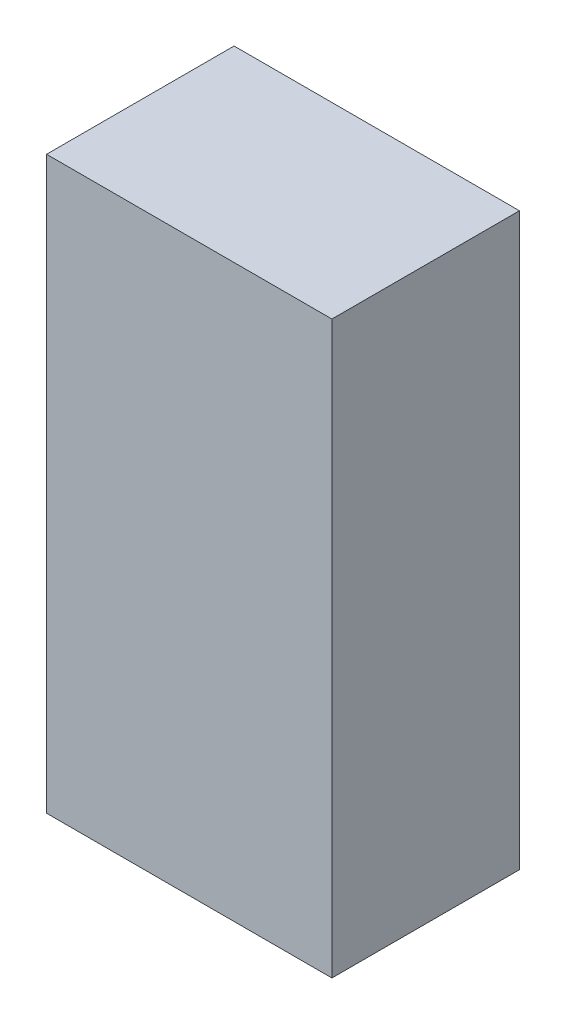
ISO-10303-21;
HEADER;
FILE_DESCRIPTION(('STEP AP214'),'2;1');
FILE_NAME('part.step','',(''),(''),'','','');
FILE_SCHEMA(('AUTOMOTIVE_DESIGN { 1 0 10303 214 1 1 1 1 }'));
ENDSEC;
DATA;
#1=APPLICATION_CONTEXT('core data for automotive mechanical design processes');
#2=APPLICATION_PROTOCOL_DEFINITION('international standard','automotive_design',2000,#1);
#3=PRODUCT_CONTEXT('',#1,'mechanical');
#4=PRODUCT('Part','Part','',(#3));
#5=PRODUCT_RELATED_PRODUCT_CATEGORY('part','',(#4));
#6=PRODUCT_DEFINITION_FORMATION('','',#4);
#7=PRODUCT_DEFINITION_CONTEXT('part definition',#1,'design');
#8=PRODUCT_DEFINITION('design','',#6,#7);
#9=PRODUCT_DEFINITION_SHAPE('','',#8);
#10=(LENGTH_UNIT() NAMED_UNIT(*) SI_UNIT(.MILLI.,.METRE.));
#11=(NAMED_UNIT(*) PLANE_ANGLE_UNIT() SI_UNIT($,.RADIAN.));
#12=(NAMED_UNIT(*) SI_UNIT($,.STERADIAN.) SOLID_ANGLE_UNIT());
#13=UNCERTAINTY_MEASURE_WITH_UNIT(LENGTH_MEASURE(1.E-05),#10,'distance_accuracy_value','');
#14=(GEOMETRIC_REPRESENTATION_CONTEXT(3) GLOBAL_UNCERTAINTY_ASSIGNED_CONTEXT((#13)) GLOBAL_UNIT_ASSIGNED_CONTEXT((#10,
#11,#12)) REPRESENTATION_CONTEXT('',''));
#15=CARTESIAN_POINT('',(0.,0.,0.));
#16=DIRECTION('',(0.,0.,1.));
#17=DIRECTION('',(1.,0.,0.));
#18=AXIS2_PLACEMENT_3D('',#15,#16,#17);
#19=CARTESIAN_POINT('',(17.5,70.,11.5));
#20=DIRECTION('',(-1.,0.,0.));
#21=DIRECTION('',(0.,0.,1.));
#22=AXIS2_PLACEMENT_3D('',#19,#20,#21);
#23=PLANE('',#22);
#24=DIRECTION('',(0.,0.,-1.));
#25=VECTOR('',#24,1.);
#26=CARTESIAN_POINT('',(17.5,0.,11.5));
#27=LINE('',#26,#25);
#28=CARTESIAN_POINT('',(17.5,0.,11.5));
#29=VERTEX_POINT('',#28);
#30=CARTESIAN_POINT('',(17.5,0.,-11.5));
#31=VERTEX_POINT('',#30);
#32=EDGE_CURVE('E98',#29,#31,#27,.T.);
#33=ORIENTED_EDGE('',*,*,#32,.T.);
#34=DIRECTION('',(0.,-1.,0.));
#35=VECTOR('',#34,1.);
#36=CARTESIAN_POINT('',(17.5,70.,-11.5));
#37=LINE('',#36,#35);
#38=CARTESIAN_POINT('',(17.5,70.,-11.5));
#39=VERTEX_POINT('',#38);
#40=EDGE_CURVE('E11',#39,#31,#37,.T.);
#41=ORIENTED_EDGE('',*,*,#40,.F.);
#42=DIRECTION('',(0.,0.,-1.));
#43=VECTOR('',#42,1.);
#44=CARTESIAN_POINT('',(17.5,70.,11.5));
#45=LINE('',#44,#43);
#46=CARTESIAN_POINT('',(17.5,70.,11.5));
#47=VERTEX_POINT('',#46);
#48=EDGE_CURVE('E86',#47,#39,#45,.T.);
#49=ORIENTED_EDGE('',*,*,#48,.F.);
#50=DIRECTION('',(0.,-1.,0.));
#51=VECTOR('',#50,1.);
#52=CARTESIAN_POINT('',(17.5,70.,11.5));
#53=LINE('',#52,#51);
#54=EDGE_CURVE('E94',#47,#29,#53,.T.);
#55=ORIENTED_EDGE('',*,*,#54,.T.);
#56=EDGE_LOOP('',(#33,#41,#49,#55));
#57=FACE_BOUND('',#56,.T.);
#58=ADVANCED_FACE('F35',(#57),#23,.F.);
#59=CARTESIAN_POINT('',(-17.5,70.,-11.5));
#60=DIRECTION('',(0.,0.,1.));
#61=DIRECTION('',(1.,0.,0.));
#62=AXIS2_PLACEMENT_3D('',#59,#60,#61);
#63=PLANE('',#62);
#64=DIRECTION('',(-1.,0.,0.));
#65=VECTOR('',#64,1.);
#66=CARTESIAN_POINT('',(-17.5,0.,-11.5));
#67=LINE('',#66,#65);
#68=CARTESIAN_POINT('',(-17.5,0.,-11.5));
#69=VERTEX_POINT('',#68);
#70=EDGE_CURVE('E90',#31,#69,#67,.T.);
#71=ORIENTED_EDGE('',*,*,#70,.T.);
#72=DIRECTION('',(0.,-1.,0.));
#73=VECTOR('',#72,1.);
#74=CARTESIAN_POINT('',(-17.5,70.,-11.5));
#75=LINE('',#74,#73);
#76=CARTESIAN_POINT('',(-17.5,70.,-11.5));
#77=VERTEX_POINT('',#76);
#78=EDGE_CURVE('E43',#77,#69,#75,.T.);
#79=ORIENTED_EDGE('',*,*,#78,.F.);
#80=DIRECTION('',(-1.,0.,0.));
#81=VECTOR('',#80,1.);
#82=CARTESIAN_POINT('',(-17.5,70.,-11.5));
#83=LINE('',#82,#81);
#84=EDGE_CURVE('E81',#39,#77,#83,.T.);
#85=ORIENTED_EDGE('',*,*,#84,.F.);
#86=ORIENTED_EDGE('',*,*,#40,.T.);
#87=EDGE_LOOP('',(#71,#79,#85,#86));
#88=FACE_BOUND('',#87,.T.);
#89=ADVANCED_FACE('F89',(#88),#63,.F.);
#90=CARTESIAN_POINT('',(-17.5,70.,11.5));
#91=DIRECTION('',(1.,0.,0.));
#92=DIRECTION('',(0.,0.,-1.));
#93=AXIS2_PLACEMENT_3D('',#90,#91,#92);
#94=PLANE('',#93);
#95=DIRECTION('',(0.,0.,1.));
#96=VECTOR('',#95,1.);
#97=CARTESIAN_POINT('',(-17.5,0.,11.5));
#98=LINE('',#97,#96);
#99=CARTESIAN_POINT('',(-17.5,0.,11.5));
#100=VERTEX_POINT('',#99);
#101=EDGE_CURVE('E68',#69,#100,#98,.T.);
#102=ORIENTED_EDGE('',*,*,#101,.T.);
#103=DIRECTION('',(0.,-1.,0.));
#104=VECTOR('',#103,1.);
#105=CARTESIAN_POINT('',(-17.5,70.,11.5));
#106=LINE('',#105,#104);
#107=CARTESIAN_POINT('',(-17.5,70.,11.5));
#108=VERTEX_POINT('',#107);
#109=EDGE_CURVE('E91',#108,#100,#106,.T.);
#110=ORIENTED_EDGE('',*,*,#109,.F.);
#111=DIRECTION('',(0.,0.,1.));
#112=VECTOR('',#111,1.);
#113=CARTESIAN_POINT('',(-17.5,70.,11.5));
#114=LINE('',#113,#112);
#115=EDGE_CURVE('E84',#77,#108,#114,.T.);
#116=ORIENTED_EDGE('',*,*,#115,.F.);
#117=ORIENTED_EDGE('',*,*,#78,.T.);
#118=EDGE_LOOP('',(#102,#110,#116,#117));
#119=FACE_BOUND('',#118,.T.);
#120=ADVANCED_FACE('F92',(#119),#94,.F.);
#121=CARTESIAN_POINT('',(-17.5,70.,11.5));
#122=DIRECTION('',(0.,0.,-1.));
#123=DIRECTION('',(-1.,0.,0.));
#124=AXIS2_PLACEMENT_3D('',#121,#122,#123);
#125=PLANE('',#124);
#126=DIRECTION('',(1.,0.,0.));
#127=VECTOR('',#126,1.);
#128=CARTESIAN_POINT('',(-17.5,0.,11.5));
#129=LINE('',#128,#127);
#130=EDGE_CURVE('E74',#100,#29,#129,.T.);
#131=ORIENTED_EDGE('',*,*,#130,.T.);
#132=ORIENTED_EDGE('',*,*,#54,.F.);
#133=DIRECTION('',(1.,0.,0.));
#134=VECTOR('',#133,1.);
#135=CARTESIAN_POINT('',(-17.5,70.,11.5));
#136=LINE('',#135,#134);
#137=EDGE_CURVE('E51',#108,#47,#136,.T.);
#138=ORIENTED_EDGE('',*,*,#137,.F.);
#139=ORIENTED_EDGE('',*,*,#109,.T.);
#140=EDGE_LOOP('',(#131,#132,#138,#139));
#141=FACE_BOUND('',#140,.T.);
#142=ADVANCED_FACE('F105',(#141),#125,.F.);
#143=CARTESIAN_POINT('',(0.,70.,0.));
#144=DIRECTION('',(0.,-1.,0.));
#145=DIRECTION('',(0.,0.,-1.));
#146=AXIS2_PLACEMENT_3D('',#143,#144,#145);
#147=PLANE('',#146);
#148=ORIENTED_EDGE('',*,*,#48,.T.);
#149=ORIENTED_EDGE('',*,*,#84,.T.);
#150=ORIENTED_EDGE('',*,*,#115,.T.);
#151=ORIENTED_EDGE('',*,*,#137,.T.);
#152=EDGE_LOOP('',(#148,#149,#150,#151));
#153=FACE_BOUND('',#152,.T.);
#154=ADVANCED_FACE('F82',(#153),#147,.F.);
#155=CARTESIAN_POINT('',(0.,0.,0.));
#156=DIRECTION('',(0.,-1.,0.));
#157=DIRECTION('',(0.,0.,-1.));
#158=AXIS2_PLACEMENT_3D('',#155,#156,#157);
#159=PLANE('',#158);
#160=ORIENTED_EDGE('',*,*,#32,.F.);
#161=ORIENTED_EDGE('',*,*,#130,.F.);
#162=ORIENTED_EDGE('',*,*,#101,.F.);
#163=ORIENTED_EDGE('',*,*,#70,.F.);
#164=EDGE_LOOP('',(#160,#161,#162,#163));
#165=FACE_BOUND('',#164,.T.);
#166=ADVANCED_FACE('F108',(#165),#159,.T.);
#167=CLOSED_SHELL('',(#58,#89,#120,#142,#154,#166));
#168=MANIFOLD_SOLID_BREP('B2',#167);
#169=ADVANCED_BREP_SHAPE_REPRESENTATION('',(#18,#168),#14);
#170=SHAPE_DEFINITION_REPRESENTATION(#9,#169);
ENDSEC;
END-ISO-10303-21;
